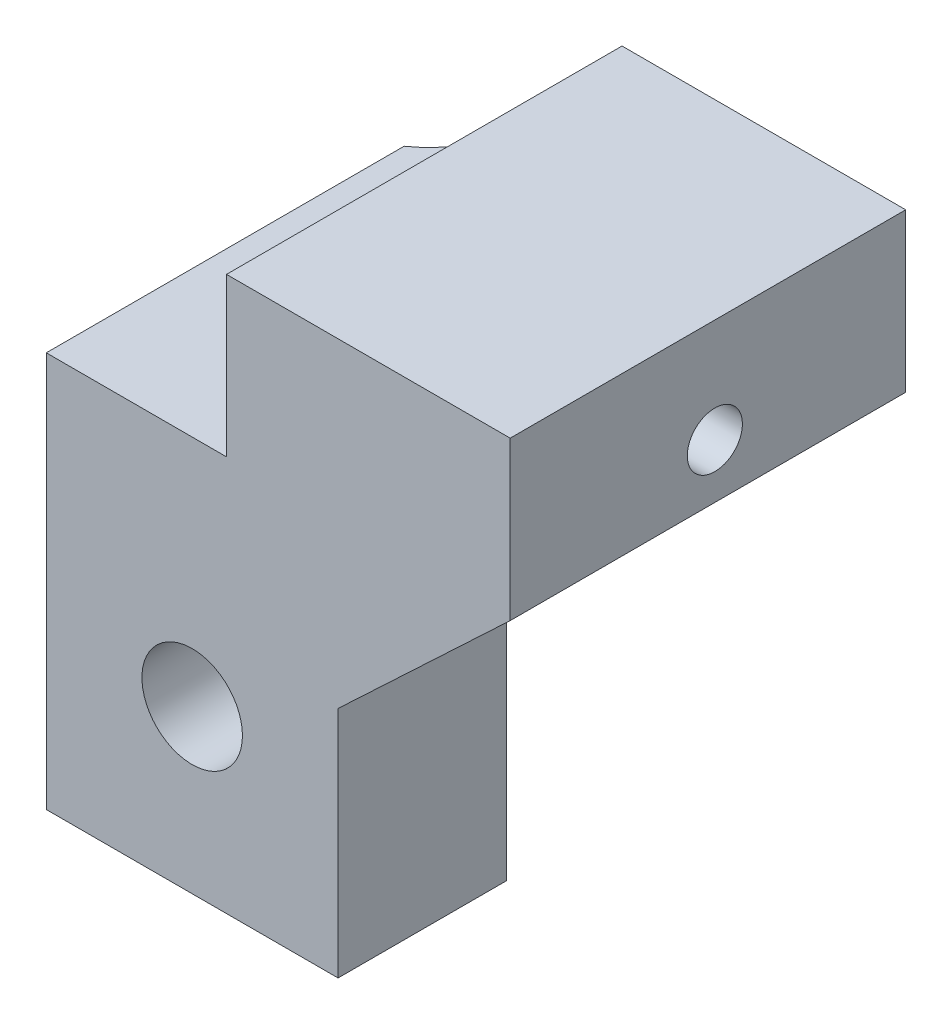
ISO-10303-21;
HEADER;
FILE_DESCRIPTION(('STEP AP214'),'2;1');
FILE_NAME('part.step','',(''),(''),'','','');
FILE_SCHEMA(('AUTOMOTIVE_DESIGN { 1 0 10303 214 1 1 1 1 }'));
ENDSEC;
DATA;
#1=APPLICATION_CONTEXT('core data for automotive mechanical design processes');
#2=APPLICATION_PROTOCOL_DEFINITION('international standard','automotive_design',2000,#1);
#3=PRODUCT_CONTEXT('',#1,'mechanical');
#4=PRODUCT('Part','Part','',(#3));
#5=PRODUCT_RELATED_PRODUCT_CATEGORY('part','',(#4));
#6=PRODUCT_DEFINITION_FORMATION('','',#4);
#7=PRODUCT_DEFINITION_CONTEXT('part definition',#1,'design');
#8=PRODUCT_DEFINITION('design','',#6,#7);
#9=PRODUCT_DEFINITION_SHAPE('','',#8);
#10=(LENGTH_UNIT() NAMED_UNIT(*) SI_UNIT(.MILLI.,.METRE.));
#11=(NAMED_UNIT(*) PLANE_ANGLE_UNIT() SI_UNIT($,.RADIAN.));
#12=(NAMED_UNIT(*) SI_UNIT($,.STERADIAN.) SOLID_ANGLE_UNIT());
#13=UNCERTAINTY_MEASURE_WITH_UNIT(LENGTH_MEASURE(1.E-05),#10,'distance_accuracy_value','');
#14=(GEOMETRIC_REPRESENTATION_CONTEXT(3) GLOBAL_UNCERTAINTY_ASSIGNED_CONTEXT((#13)) GLOBAL_UNIT_ASSIGNED_CONTEXT((#10,
#11,#12)) REPRESENTATION_CONTEXT('',''));
#15=CARTESIAN_POINT('',(0.,0.,0.));
#16=DIRECTION('',(0.,0.,1.));
#17=DIRECTION('',(1.,0.,0.));
#18=AXIS2_PLACEMENT_3D('',#15,#16,#17);
#19=CARTESIAN_POINT('',(0.,58.3213619677035,-79.4485430781272));
#20=DIRECTION('',(0.,1.,0.));
#21=DIRECTION('',(0.,0.,1.));
#22=AXIS2_PLACEMENT_3D('',#19,#20,#21);
#23=PLANE('',#22);
#24=DIRECTION('',(-1.,0.,0.));
#25=VECTOR('',#24,1.);
#26=CARTESIAN_POINT('',(-6.98017986041871E-13,58.3213619677033,-50.1703520079206));
#27=LINE('',#26,#25);
#28=CARTESIAN_POINT('',(-2.2129908913706,58.3213619677033,-50.1703520079205));
#29=VERTEX_POINT('',#28);
#30=CARTESIAN_POINT('',(-11.2129908913706,58.3213619677033,-50.1703520079204));
#31=VERTEX_POINT('',#30);
#32=EDGE_CURVE('E209',#29,#31,#27,.T.);
#33=ORIENTED_EDGE('',*,*,#32,.F.);
#34=DIRECTION('',(0.,0.,1.));
#35=VECTOR('',#34,1.);
#36=CARTESIAN_POINT('',(-2.2129908913707,58.3213619677035,-79.4485430781272));
#37=LINE('',#36,#35);
#38=CARTESIAN_POINT('',(-2.2129908913707,58.3213619677035,-44.9703520079224));
#39=VERTEX_POINT('',#38);
#40=EDGE_CURVE('E80',#29,#39,#37,.T.);
#41=ORIENTED_EDGE('',*,*,#40,.T.);
#42=DIRECTION('',(-1.,0.,0.));
#43=VECTOR('',#42,1.);
#44=CARTESIAN_POINT('',(0.,58.3213619677035,-44.9703520079224));
#45=LINE('',#44,#43);
#46=CARTESIAN_POINT('',(-11.2129908913707,58.3213619677035,-44.9703520079224));
#47=VERTEX_POINT('',#46);
#48=EDGE_CURVE('E152',#39,#47,#45,.T.);
#49=ORIENTED_EDGE('',*,*,#48,.T.);
#50=DIRECTION('',(0.,0.,1.));
#51=VECTOR('',#50,1.);
#52=CARTESIAN_POINT('',(-11.2129908913707,58.3213619677035,-79.4485430781272));
#53=LINE('',#52,#51);
#54=EDGE_CURVE('E154',#31,#47,#53,.T.);
#55=ORIENTED_EDGE('',*,*,#54,.F.);
#56=EDGE_LOOP('',(#33,#41,#49,#55));
#57=FACE_BOUND('',#56,.T.);
#58=ADVANCED_FACE('F41',(#57),#23,.F.);
#59=CARTESIAN_POINT('',(-2.21299089137069,0.,-79.4485430781272));
#60=DIRECTION('',(-1.,0.,0.));
#61=DIRECTION('',(0.,-1.,0.));
#62=AXIS2_PLACEMENT_3D('',#59,#60,#61);
#63=PLANE('',#62);
#64=DIRECTION('',(0.,-1.,0.));
#65=VECTOR('',#64,1.);
#66=CARTESIAN_POINT('',(-2.21299089137059,1.57288822703923E-12,-50.1703520079224));
#67=LINE('',#66,#65);
#68=CARTESIAN_POINT('',(-2.21299089137061,65.5217988777951,-50.1703520079203));
#69=VERTEX_POINT('',#68);
#70=EDGE_CURVE('E430',#69,#29,#67,.T.);
#71=ORIENTED_EDGE('',*,*,#70,.F.);
#72=DIRECTION('',(0.,0.,1.));
#73=VECTOR('',#72,1.);
#74=CARTESIAN_POINT('',(-2.2129908913707,65.5217988777953,-79.4485430781272));
#75=LINE('',#74,#73);
#76=CARTESIAN_POINT('',(-2.2129908913707,65.5217988777953,-44.9703520079224));
#77=VERTEX_POINT('',#76);
#78=EDGE_CURVE('E66',#69,#77,#75,.T.);
#79=ORIENTED_EDGE('',*,*,#78,.T.);
#80=DIRECTION('',(0.,-1.,0.));
#81=VECTOR('',#80,1.);
#82=CARTESIAN_POINT('',(-2.21299089137069,0.,-44.9703520079224));
#83=LINE('',#82,#81);
#84=EDGE_CURVE('E149',#77,#39,#83,.T.);
#85=ORIENTED_EDGE('',*,*,#84,.T.);
#86=ORIENTED_EDGE('',*,*,#40,.F.);
#87=EDGE_LOOP('',(#71,#79,#85,#86));
#88=FACE_BOUND('',#87,.T.);
#89=ADVANCED_FACE('F262',(#88),#63,.F.);
#90=CARTESIAN_POINT('',(-6.7129908913707,63.3213619677035,-57.1713520079206));
#91=DIRECTION('',(0.,0.,1.));
#92=DIRECTION('',(1.,0.,0.));
#93=AXIS2_PLACEMENT_3D('',#90,#91,#92);
#94=CYLINDRICAL_SURFACE('',#93,1.55000000000251);
#95=CARTESIAN_POINT('',(-6.7129908913707,63.3213619677035,-44.9703520079224));
#96=DIRECTION('',(0.,0.,1.));
#97=DIRECTION('',(1.,0.,0.));
#98=AXIS2_PLACEMENT_3D('',#95,#96,#97);
#99=CIRCLE('',#98,1.55000000000251);
#100=CARTESIAN_POINT('',(-5.16299089136819,63.3213619677035,-44.9703520079224));
#101=VERTEX_POINT('',#100);
#102=EDGE_CURVE('E180',#101,#101,#99,.T.);
#103=ORIENTED_EDGE('',*,*,#102,.T.);
#104=EDGE_LOOP('',(#103));
#105=FACE_BOUND('',#104,.T.);
#106=CARTESIAN_POINT('',(-6.7129908913706,63.3213619677033,-50.1703520079203));
#107=DIRECTION('',(0.,0.,-1.));
#108=DIRECTION('',(0.,1.,0.));
#109=AXIS2_PLACEMENT_3D('',#106,#107,#108);
#110=CIRCLE('',#109,1.55000000000251);
#111=CARTESIAN_POINT('',(-6.7129908913706,64.8713619677058,-50.1703520079203));
#112=VERTEX_POINT('',#111);
#113=EDGE_CURVE('E236',#112,#112,#110,.F.);
#114=ORIENTED_EDGE('',*,*,#113,.F.);
#115=EDGE_LOOP('',(#114));
#116=FACE_BOUND('',#115,.T.);
#117=ADVANCED_FACE('F245',(#105,#116),#94,.F.);
#118=CARTESIAN_POINT('',(-11.2129908913707,0.,-79.4485430781272));
#119=DIRECTION('',(1.,0.,0.));
#120=DIRECTION('',(0.,0.,-1.));
#121=AXIS2_PLACEMENT_3D('',#118,#119,#120);
#122=PLANE('',#121);
#123=DIRECTION('',(0.,0.,1.));
#124=VECTOR('',#123,1.);
#125=CARTESIAN_POINT('',(-11.2129908913707,70.5217988777953,-79.4485430781272));
#126=LINE('',#125,#124);
#127=CARTESIAN_POINT('',(-11.2129908913707,70.5217988777957,-56.0078346360245));
#128=VERTEX_POINT('',#127);
#129=CARTESIAN_POINT('',(-11.2129908913707,70.5217988777953,-44.9703520079224));
#130=VERTEX_POINT('',#129);
#131=EDGE_CURVE('E166',#128,#130,#126,.T.);
#132=ORIENTED_EDGE('',*,*,#131,.F.);
#133=CARTESIAN_POINT('',(-11.2129908913707,75.0612229569695,-56.841405781884));
#134=CARTESIAN_POINT('',(-11.2129908913707,74.872437048475,-56.8034954259806));
#135=CARTESIAN_POINT('',(-11.2129908913707,74.6835394474765,-56.7661465837495));
#136=CARTESIAN_POINT('',(-11.2129908913707,74.3055563452138,-56.6924190402826));
#137=CARTESIAN_POINT('',(-11.2129908913707,74.1164708453655,-56.6560403317925));
#138=CARTESIAN_POINT('',(-11.2129908913707,73.548992647412,-56.548131367116));
#139=CARTESIAN_POINT('',(-11.2129908913707,73.1703671065986,-56.4778260527069));
#140=CARTESIAN_POINT('',(-11.2129908913707,72.412702531121,-56.3396703392661));
#141=CARTESIAN_POINT('',(-11.2129908913707,72.033663532769,-56.2718197401254));
#142=CARTESIAN_POINT('',(-11.2129908913707,71.2752458273432,-56.1380278644259));
#143=CARTESIAN_POINT('',(-11.2129908913707,70.8958671172213,-56.0720866051802));
#144=CARTESIAN_POINT('',(-11.2129908913707,69.8139285131946,-55.8862469844785));
#145=CARTESIAN_POINT('',(-11.2129908913707,69.1110543917916,-55.7681798053079));
#146=CARTESIAN_POINT('',(-11.2129908913707,67.7047175618118,-55.5356096057115));
#147=CARTESIAN_POINT('',(-11.2129908913707,67.0012548513202,-55.421106596927));
#148=CARTESIAN_POINT('',(-11.2129908913707,65.5938027524495,-55.1946784781128));
#149=CARTESIAN_POINT('',(-11.2129908913707,64.8898132989491,-55.0827537736952));
#150=CARTESIAN_POINT('',(-11.2129908913707,63.4815296379253,-54.8609052960924));
#151=CARTESIAN_POINT('',(-11.2129908913707,62.7772354350958,-54.7509814931379));
#152=CARTESIAN_POINT('',(-11.2129908913707,62.0728344229137,-54.6417587537169));
#153=B_SPLINE_CURVE_WITH_KNOTS('',3,(#133,#134,#135,#136,#137,#138,#139,#140,#141,#142,#143,
#144,#145,#146,#147,#148,#149,#150,#151,#152),.UNSPECIFIED.,.F.,.F.,(4,2,2,2,2,2,2,2,2,4),(0.,
0.57766168012299,1.15531903948039,2.31059967031259,3.46578590914154,4.62098261940444,
6.75913179303867,8.89728794962263,11.0357782095138,13.1742366270822),.UNSPECIFIED.);
#154=CARTESIAN_POINT('',(-11.2129908913706,66.6122585020879,-55.3586158408552));
#155=VERTEX_POINT('',#154);
#156=EDGE_CURVE('E226',#128,#155,#153,.T.);
#157=ORIENTED_EDGE('',*,*,#156,.T.);
#158=DIRECTION('',(0.,0.,1.));
#159=VECTOR('',#158,1.);
#160=CARTESIAN_POINT('',(-11.2129908913707,66.6122585020886,-57.1703640079202));
#161=LINE('',#160,#159);
#162=CARTESIAN_POINT('',(-11.2129908913706,66.6122585020884,-50.1703520079202));
#163=VERTEX_POINT('',#162);
#164=EDGE_CURVE('E229',#155,#163,#161,.T.);
#165=ORIENTED_EDGE('',*,*,#164,.T.);
#166=DIRECTION('',(0.,1.,0.));
#167=VECTOR('',#166,1.);
#168=CARTESIAN_POINT('',(-11.2129908913706,1.5731692540542E-12,-50.1703520079223));
#169=LINE('',#168,#167);
#170=EDGE_CURVE('E206',#31,#163,#169,.T.);
#171=ORIENTED_EDGE('',*,*,#170,.F.);
#172=ORIENTED_EDGE('',*,*,#54,.T.);
#173=DIRECTION('',(0.,1.,0.));
#174=VECTOR('',#173,1.);
#175=CARTESIAN_POINT('',(-11.2129908913707,0.,-44.9703520079224));
#176=LINE('',#175,#174);
#177=EDGE_CURVE('E165',#47,#130,#176,.T.);
#178=ORIENTED_EDGE('',*,*,#177,.T.);
#179=EDGE_LOOP('',(#132,#157,#165,#171,#172,#178));
#180=FACE_BOUND('',#179,.T.);
#181=ADVANCED_FACE('F202',(#180),#122,.F.);
#182=CARTESIAN_POINT('',(0.,70.5217988777953,-79.4485430781272));
#183=DIRECTION('',(0.,-1.,0.));
#184=DIRECTION('',(0.,0.,-1.));
#185=AXIS2_PLACEMENT_3D('',#182,#183,#184);
#186=PLANE('',#185);
#187=DIRECTION('',(1.,0.,0.));
#188=VECTOR('',#187,1.);
#189=CARTESIAN_POINT('',(3.07923267587147E-13,70.5217988777953,-57.1703520079202));
#190=LINE('',#189,#188);
#191=CARTESIAN_POINT('',(-10.1942877059486,70.5217988777957,-57.1703520079201));
#192=VERTEX_POINT('',#191);
#193=CARTESIAN_POINT('',(-5.65399890415775,70.5217988777953,-57.17035200792));
#194=VERTEX_POINT('',#193);
#195=EDGE_CURVE('E151',#192,#194,#190,.T.);
#196=ORIENTED_EDGE('',*,*,#195,.F.);
#197=CARTESIAN_POINT('',(-13.0929908913772,70.5217988777957,-58.6828599507033));
#198=DIRECTION('',(0.,1.,0.));
#199=DIRECTION('',(0.,0.,1.));
#200=AXIS2_PLACEMENT_3D('',#197,#198,#199);
#201=CIRCLE('',#200,3.26958107931224);
#202=EDGE_CURVE('E199',#128,#192,#201,.T.);
#203=ORIENTED_EDGE('',*,*,#202,.F.);
#204=ORIENTED_EDGE('',*,*,#131,.T.);
#205=DIRECTION('',(1.,0.,0.));
#206=VECTOR('',#205,1.);
#207=CARTESIAN_POINT('',(0.,70.5217988777953,-44.9703520079224));
#208=LINE('',#207,#206);
#209=CARTESIAN_POINT('',(-5.65399890415775,70.5217988777953,-44.9703520079224));
#210=VERTEX_POINT('',#209);
#211=EDGE_CURVE('E168',#130,#210,#208,.T.);
#212=ORIENTED_EDGE('',*,*,#211,.T.);
#213=DIRECTION('',(0.,0.,1.));
#214=VECTOR('',#213,1.);
#215=CARTESIAN_POINT('',(-5.65399890415775,70.5217988777953,-79.4485430781272));
#216=LINE('',#215,#214);
#217=EDGE_CURVE('E169',#194,#210,#216,.T.);
#218=ORIENTED_EDGE('',*,*,#217,.F.);
#219=EDGE_LOOP('',(#196,#203,#204,#212,#218));
#220=FACE_BOUND('',#219,.T.);
#221=ADVANCED_FACE('F195',(#220),#186,.F.);
#222=CARTESIAN_POINT('',(-5.65399890415775,0.,-79.4485430781272));
#223=DIRECTION('',(1.,0.,0.));
#224=DIRECTION('',(0.,0.,-1.));
#225=AXIS2_PLACEMENT_3D('',#222,#223,#224);
#226=PLANE('',#225);
#227=CARTESIAN_POINT('',(-5.653998904158,72.1958924315079,-51.282859950686));
#228=DIRECTION('',(-1.,0.,0.));
#229=DIRECTION('',(0.,-1.,0.));
#230=AXIS2_PLACEMENT_3D('',#227,#228,#229);
#231=CIRCLE('',#230,0.849999999999994);
#232=CARTESIAN_POINT('',(-5.653998904158,71.3458924315079,-51.282859950686));
#233=VERTEX_POINT('',#232);
#234=EDGE_CURVE('E175',#233,#233,#231,.T.);
#235=ORIENTED_EDGE('',*,*,#234,.F.);
#236=EDGE_LOOP('',(#235));
#237=FACE_BOUND('',#236,.T.);
#238=DIRECTION('',(0.,1.,0.));
#239=VECTOR('',#238,1.);
#240=CARTESIAN_POINT('',(-5.65399890415775,-7.02528371530534E-13,-57.1703520079223));
#241=LINE('',#240,#239);
#242=CARTESIAN_POINT('',(-5.65399890415775,75.3967988777949,-57.17035200792));
#243=VERTEX_POINT('',#242);
#244=EDGE_CURVE('E160',#194,#243,#241,.T.);
#245=ORIENTED_EDGE('',*,*,#244,.F.);
#246=ORIENTED_EDGE('',*,*,#217,.T.);
#247=DIRECTION('',(0.,1.,0.));
#248=VECTOR('',#247,1.);
#249=CARTESIAN_POINT('',(-5.65399890415775,0.,-44.9703520079224));
#250=LINE('',#249,#248);
#251=CARTESIAN_POINT('',(-5.65399890415775,75.3967988777949,-44.9703520079224));
#252=VERTEX_POINT('',#251);
#253=EDGE_CURVE('E171',#210,#252,#250,.T.);
#254=ORIENTED_EDGE('',*,*,#253,.T.);
#255=DIRECTION('',(0.,0.,1.));
#256=VECTOR('',#255,1.);
#257=CARTESIAN_POINT('',(-5.65399890415775,75.3967988777949,-79.4485430781272));
#258=LINE('',#257,#256);
#259=EDGE_CURVE('E134',#243,#252,#258,.T.);
#260=ORIENTED_EDGE('',*,*,#259,.F.);
#261=EDGE_LOOP('',(#245,#246,#254,#260));
#262=FACE_BOUND('',#261,.T.);
#263=ADVANCED_FACE('F189',(#237,#262),#226,.F.);
#264=CARTESIAN_POINT('',(0.,75.3967988777949,-79.4485430781272));
#265=DIRECTION('',(0.,-1.,0.));
#266=DIRECTION('',(0.,0.,-1.));
#267=AXIS2_PLACEMENT_3D('',#264,#265,#266);
#268=PLANE('',#267);
#269=DIRECTION('',(1.,0.,0.));
#270=VECTOR('',#269,1.);
#271=CARTESIAN_POINT('',(3.07923267587149E-13,75.3967988777949,-57.17035200792));
#272=LINE('',#271,#270);
#273=CARTESIAN_POINT('',(3.09600109584225,75.3967988777953,-57.1703520079202));
#274=VERTEX_POINT('',#273);
#275=EDGE_CURVE('E158',#243,#274,#272,.T.);
#276=ORIENTED_EDGE('',*,*,#275,.F.);
#277=ORIENTED_EDGE('',*,*,#259,.T.);
#278=DIRECTION('',(1.,0.,0.));
#279=VECTOR('',#278,1.);
#280=CARTESIAN_POINT('',(0.,75.3967988777949,-44.9703520079224));
#281=LINE('',#280,#279);
#282=CARTESIAN_POINT('',(3.09600109584225,75.3967988777953,-44.9703520079224));
#283=VERTEX_POINT('',#282);
#284=EDGE_CURVE('E129',#252,#283,#281,.T.);
#285=ORIENTED_EDGE('',*,*,#284,.T.);
#286=DIRECTION('',(0.,0.,1.));
#287=VECTOR('',#286,1.);
#288=CARTESIAN_POINT('',(3.09600109584225,75.3967988777953,-79.4485430781272));
#289=LINE('',#288,#287);
#290=EDGE_CURVE('E118',#274,#283,#289,.T.);
#291=ORIENTED_EDGE('',*,*,#290,.F.);
#292=EDGE_LOOP('',(#276,#277,#285,#291));
#293=FACE_BOUND('',#292,.T.);
#294=ADVANCED_FACE('F132',(#293),#268,.F.);
#295=CARTESIAN_POINT('',(3.09600109584224,0.,-79.4485430781272));
#296=DIRECTION('',(-1.,0.,0.));
#297=DIRECTION('',(0.,-1.,0.));
#298=AXIS2_PLACEMENT_3D('',#295,#296,#297);
#299=PLANE('',#298);
#300=CARTESIAN_POINT('',(3.09600109584225,72.195892431508,-51.282859950686));
#301=DIRECTION('',(-1.,0.,0.));
#302=DIRECTION('',(0.,-1.,0.));
#303=AXIS2_PLACEMENT_3D('',#300,#301,#302);
#304=CIRCLE('',#303,0.849999999999994);
#305=CARTESIAN_POINT('',(3.09600109584225,71.345892431508,-51.282859950686));
#306=VERTEX_POINT('',#305);
#307=EDGE_CURVE('E173',#306,#306,#304,.F.);
#308=ORIENTED_EDGE('',*,*,#307,.F.);
#309=EDGE_LOOP('',(#308));
#310=FACE_BOUND('',#309,.T.);
#311=DIRECTION('',(0.,-1.,0.));
#312=VECTOR('',#311,1.);
#313=CARTESIAN_POINT('',(3.09600109584224,-7.02803792339894E-13,-57.1703520079225));
#314=LINE('',#313,#312);
#315=CARTESIAN_POINT('',(3.09600109584225,70.5217988777953,-57.1703520079203));
#316=VERTEX_POINT('',#315);
#317=EDGE_CURVE('E126',#274,#316,#314,.T.);
#318=ORIENTED_EDGE('',*,*,#317,.F.);
#319=ORIENTED_EDGE('',*,*,#290,.T.);
#320=DIRECTION('',(0.,-1.,0.));
#321=VECTOR('',#320,1.);
#322=CARTESIAN_POINT('',(3.09600109584224,0.,-44.9703520079224));
#323=LINE('',#322,#321);
#324=CARTESIAN_POINT('',(3.09600109584225,70.5217988777953,-44.9703520079224));
#325=VERTEX_POINT('',#324);
#326=EDGE_CURVE('E123',#283,#325,#323,.T.);
#327=ORIENTED_EDGE('',*,*,#326,.T.);
#328=DIRECTION('',(0.,0.,1.));
#329=VECTOR('',#328,1.);
#330=CARTESIAN_POINT('',(3.09600109584225,70.5217988777953,-79.4485430781272));
#331=LINE('',#330,#329);
#332=EDGE_CURVE('E143',#316,#325,#331,.T.);
#333=ORIENTED_EDGE('',*,*,#332,.F.);
#334=EDGE_LOOP('',(#318,#319,#327,#333));
#335=FACE_BOUND('',#334,.T.);
#336=ADVANCED_FACE('F120',(#310,#335),#299,.F.);
#337=CARTESIAN_POINT('',(-33.7423134185894,35.8275343138638,-79.4485430781272));
#338=DIRECTION('',(-0.685604731472103,0.727974005156136,0.));
#339=DIRECTION('',(-0.727974005156136,-0.685604731472103,0.));
#340=AXIS2_PLACEMENT_3D('',#337,#338,#339);
#341=PLANE('',#340);
#342=DIRECTION('',(-0.727974005156136,-0.685604731472103,0.));
#343=VECTOR('',#342,1.);
#344=CARTESIAN_POINT('',(-33.7423134185889,35.827534313864,-50.1703520079208));
#345=LINE('',#344,#343);
#346=CARTESIAN_POINT('',(-1.05514260982011,66.6122585020884,-50.1703520079203));
#347=VERTEX_POINT('',#346);
#348=EDGE_CURVE('E429',#347,#69,#345,.T.);
#349=ORIENTED_EDGE('',*,*,#348,.F.);
#350=DIRECTION('',(0.,0.,1.));
#351=VECTOR('',#350,1.);
#352=CARTESIAN_POINT('',(-1.05514260982021,66.6122585020886,-57.1703640079203));
#353=LINE('',#352,#351);
#354=CARTESIAN_POINT('',(-1.05514260982021,66.6122585020886,-57.1703520079203));
#355=VERTEX_POINT('',#354);
#356=EDGE_CURVE('E235',#355,#347,#353,.T.);
#357=ORIENTED_EDGE('',*,*,#356,.F.);
#358=DIRECTION('',(-0.727974005156136,-0.685604731472103,0.));
#359=VECTOR('',#358,1.);
#360=CARTESIAN_POINT('',(-33.7423134185896,35.8275343138636,-57.1703520079208));
#361=LINE('',#360,#359);
#362=EDGE_CURVE('E50',#316,#355,#361,.T.);
#363=ORIENTED_EDGE('',*,*,#362,.F.);
#364=ORIENTED_EDGE('',*,*,#332,.T.);
#365=DIRECTION('',(-0.727974005156136,-0.685604731472103,0.));
#366=VECTOR('',#365,1.);
#367=CARTESIAN_POINT('',(-33.7423134185894,35.8275343138638,-44.9703520079224));
#368=LINE('',#367,#366);
#369=EDGE_CURVE('E142',#325,#77,#368,.T.);
#370=ORIENTED_EDGE('',*,*,#369,.T.);
#371=ORIENTED_EDGE('',*,*,#78,.F.);
#372=EDGE_LOOP('',(#349,#357,#363,#364,#370,#371));
#373=FACE_BOUND('',#372,.T.);
#374=ADVANCED_FACE('F249',(#373),#341,.F.);
#375=CARTESIAN_POINT('',(0.,0.,-44.9703520079224));
#376=DIRECTION('',(0.,0.,1.));
#377=DIRECTION('',(1.,0.,0.));
#378=AXIS2_PLACEMENT_3D('',#375,#376,#377);
#379=PLANE('',#378);
#380=ORIENTED_EDGE('',*,*,#102,.F.);
#381=EDGE_LOOP('',(#380));
#382=FACE_BOUND('',#381,.T.);
#383=ORIENTED_EDGE('',*,*,#48,.F.);
#384=ORIENTED_EDGE('',*,*,#84,.F.);
#385=ORIENTED_EDGE('',*,*,#369,.F.);
#386=ORIENTED_EDGE('',*,*,#326,.F.);
#387=ORIENTED_EDGE('',*,*,#284,.F.);
#388=ORIENTED_EDGE('',*,*,#253,.F.);
#389=ORIENTED_EDGE('',*,*,#211,.F.);
#390=ORIENTED_EDGE('',*,*,#177,.F.);
#391=EDGE_LOOP('',(#383,#384,#385,#386,#387,#388,#389,#390));
#392=FACE_BOUND('',#391,.T.);
#393=ADVANCED_FACE('F140',(#382,#392),#379,.T.);
#394=CARTESIAN_POINT('',(-7.61799089137214,100.784298877796,-57.1703520079191));
#395=DIRECTION('',(0.,0.,-1.));
#396=DIRECTION('',(0.,-1.,0.));
#397=AXIS2_PLACEMENT_3D('',#394,#395,#396);
#398=PLANE('',#397);
#399=CARTESIAN_POINT('',(-10.9094376114567,74.8859818908653,-57.1703520079199));
#400=CARTESIAN_POINT('',(-10.8439661684042,74.5028975233675,-57.1703520079199));
#401=CARTESIAN_POINT('',(-10.7793787407783,74.1196634981916,-57.1703520079199));
#402=CARTESIAN_POINT('',(-10.6516565375381,73.3529552612998,-57.17035200792));
#403=CARTESIAN_POINT('',(-10.588521754518,72.9694810508186,-57.17035200792));
#404=CARTESIAN_POINT('',(-10.4633900150724,72.2023551108269,-57.17035200792));
#405=CARTESIAN_POINT('',(-10.4013930365803,71.8187033849073,-57.17035200792));
#406=CARTESIAN_POINT('',(-10.2783294579244,71.0512502652888,-57.17035200792));
#407=CARTESIAN_POINT('',(-10.2172628591711,70.6674488713638,-57.1703520079201));
#408=CARTESIAN_POINT('',(-10.0507982774931,69.6144824899152,-57.1703520079201));
#409=CARTESIAN_POINT('',(-9.94617791571543,68.9451946076316,-57.1703520079201));
#410=CARTESIAN_POINT('',(-9.73864695317733,67.6063537665456,-57.1703520079202));
#411=CARTESIAN_POINT('',(-9.63573635407126,66.9368008074872,-57.1703520079202));
#412=CARTESIAN_POINT('',(-9.43121581251911,65.5974723985201,-57.1703520079202));
#413=CARTESIAN_POINT('',(-9.32960591592474,64.927696941617,-57.1703520079203));
#414=CARTESIAN_POINT('',(-9.12742348229203,63.587991848444,-57.1703520079203));
#415=CARTESIAN_POINT('',(-9.02685094155283,62.9180622127327,-57.1703520079203));
#416=CARTESIAN_POINT('',(-8.9266632256954,62.248075489019,-57.1703520079203));
#417=B_SPLINE_CURVE_WITH_KNOTS('',3,(#399,#400,#401,#402,#403,#404,#405,#406,#407,#408,#409,
#410,#411,#412,#413,#414,#415,#416),.UNSPECIFIED.,.F.,.F.,(4,2,2,2,2,2,2,2,4),(0.,
1.16591343976646,2.33182093427205,3.49770579333996,4.66359241981351,6.69583540635779,
8.72808035917036,10.760396755481,12.7927058988333),.UNSPECIFIED.);
#418=CARTESIAN_POINT('',(-9.58623760309152,66.6122585020886,-57.1703520079202));
#419=VERTEX_POINT('',#418);
#420=EDGE_CURVE('E57',#192,#419,#417,.T.);
#421=ORIENTED_EDGE('',*,*,#420,.F.);
#422=ORIENTED_EDGE('',*,*,#195,.T.);
#423=ORIENTED_EDGE('',*,*,#244,.T.);
#424=ORIENTED_EDGE('',*,*,#275,.T.);
#425=ORIENTED_EDGE('',*,*,#317,.T.);
#426=ORIENTED_EDGE('',*,*,#362,.T.);
#427=DIRECTION('',(1.,0.,0.));
#428=VECTOR('',#427,1.);
#429=CARTESIAN_POINT('',(-7.61799089137209,66.6122585020886,-57.1703520079202));
#430=LINE('',#429,#428);
#431=EDGE_CURVE('E11',#419,#355,#430,.T.);
#432=ORIENTED_EDGE('',*,*,#431,.F.);
#433=EDGE_LOOP('',(#421,#422,#423,#424,#425,#426,#432));
#434=FACE_BOUND('',#433,.T.);
#435=ADVANCED_FACE('F43',(#434),#398,.T.);
#436=CARTESIAN_POINT('',(5.50016415187649,72.195892431508,-51.282859950686));
#437=DIRECTION('',(-1.,0.,0.));
#438=DIRECTION('',(0.,-1.,0.));
#439=AXIS2_PLACEMENT_3D('',#436,#437,#438);
#440=CYLINDRICAL_SURFACE('',#439,0.849999999999994);
#441=ORIENTED_EDGE('',*,*,#307,.T.);
#442=EDGE_LOOP('',(#441));
#443=FACE_BOUND('',#442,.T.);
#444=ORIENTED_EDGE('',*,*,#234,.T.);
#445=EDGE_LOOP('',(#444));
#446=FACE_BOUND('',#445,.T.);
#447=ADVANCED_FACE('F255',(#443,#446),#440,.F.);
#448=CARTESIAN_POINT('',(-8.85776857448042E-13,66.6122585020886,-57.1703640079203));
#449=DIRECTION('',(0.,1.,0.));
#450=DIRECTION('',(0.,0.,1.));
#451=AXIS2_PLACEMENT_3D('',#448,#449,#450);
#452=PLANE('',#451);
#453=ORIENTED_EDGE('',*,*,#164,.F.);
#454=CARTESIAN_POINT('',(-13.0929908913772,66.612258502088,-58.6828599507034));
#455=DIRECTION('',(0.,1.,0.));
#456=DIRECTION('',(0.,0.,1.));
#457=AXIS2_PLACEMENT_3D('',#454,#455,#456);
#458=CIRCLE('',#457,3.81903114701695);
#459=EDGE_CURVE('E224',#155,#419,#458,.T.);
#460=ORIENTED_EDGE('',*,*,#459,.T.);
#461=ORIENTED_EDGE('',*,*,#431,.T.);
#462=ORIENTED_EDGE('',*,*,#356,.T.);
#463=DIRECTION('',(-1.,0.,0.));
#464=VECTOR('',#463,1.);
#465=CARTESIAN_POINT('',(-7.89024542082915E-13,66.6122585020884,-50.1703520079203));
#466=LINE('',#465,#464);
#467=EDGE_CURVE('E231',#347,#163,#466,.T.);
#468=ORIENTED_EDGE('',*,*,#467,.T.);
#469=EDGE_LOOP('',(#453,#460,#461,#462,#468));
#470=FACE_BOUND('',#469,.T.);
#471=ADVANCED_FACE('F233',(#470),#452,.F.);
#472=CARTESIAN_POINT('',(-6.98017986041897E-13,1.5731692540542E-12,-50.1703520079224));
#473=DIRECTION('',(0.,0.,-1.));
#474=DIRECTION('',(0.,1.,0.));
#475=AXIS2_PLACEMENT_3D('',#472,#473,#474);
#476=PLANE('',#475);
#477=ORIENTED_EDGE('',*,*,#467,.F.);
#478=ORIENTED_EDGE('',*,*,#348,.T.);
#479=ORIENTED_EDGE('',*,*,#70,.T.);
#480=ORIENTED_EDGE('',*,*,#32,.T.);
#481=ORIENTED_EDGE('',*,*,#170,.T.);
#482=EDGE_LOOP('',(#477,#478,#479,#480,#481));
#483=FACE_BOUND('',#482,.T.);
#484=ORIENTED_EDGE('',*,*,#113,.T.);
#485=EDGE_LOOP('',(#484));
#486=FACE_BOUND('',#485,.T.);
#487=ADVANCED_FACE('F286',(#483,#486),#476,.T.);
#488=CARTESIAN_POINT('',(-13.0929908913772,70.5217988777957,-58.6828599507033));
#489=DIRECTION('',(0.,-1.,0.));
#490=DIRECTION('',(0.,0.,-1.));
#491=AXIS2_PLACEMENT_3D('',#488,#489,#490);
#492=CONICAL_SURFACE('',#491,3.26958107931224,0.13962634015956);
#493=ORIENTED_EDGE('',*,*,#202,.T.);
#494=ORIENTED_EDGE('',*,*,#420,.T.);
#495=ORIENTED_EDGE('',*,*,#459,.F.);
#496=ORIENTED_EDGE('',*,*,#156,.F.);
#497=EDGE_LOOP('',(#493,#494,#495,#496));
#498=FACE_BOUND('',#497,.T.);
#499=ADVANCED_FACE('F225',(#498),#492,.F.);
#500=CLOSED_SHELL('',(#58,#89,#117,#181,#221,#263,#294,#336,#374,#393,#435,#447,#471,#487,#499));
#501=MANIFOLD_SOLID_BREP('B2',#500);
#502=ADVANCED_BREP_SHAPE_REPRESENTATION('',(#18,#501),#14);
#503=SHAPE_DEFINITION_REPRESENTATION(#9,#502);
ENDSEC;
END-ISO-10303-21;
